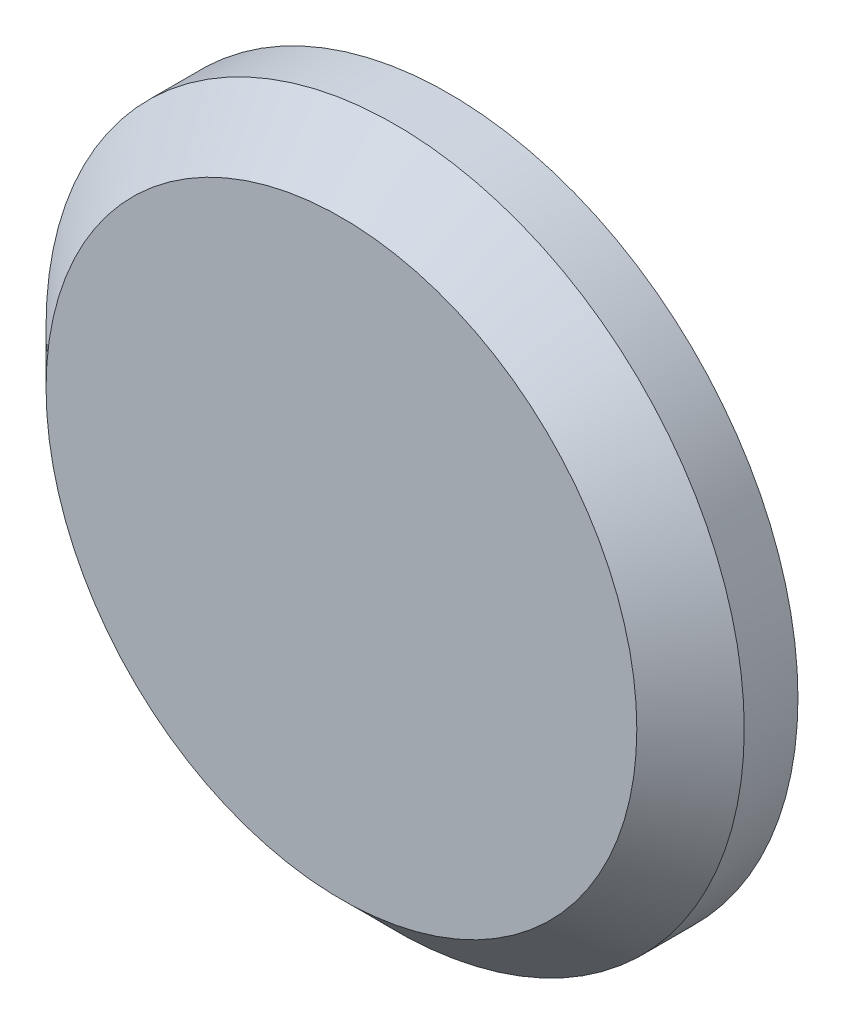
ISO-10303-21;
HEADER;
FILE_DESCRIPTION(('STEP AP214'),'2;1');
FILE_NAME('part.step','',(''),(''),'','','');
FILE_SCHEMA(('AUTOMOTIVE_DESIGN { 1 0 10303 214 1 1 1 1 }'));
ENDSEC;
DATA;
#1=APPLICATION_CONTEXT('core data for automotive mechanical design processes');
#2=APPLICATION_PROTOCOL_DEFINITION('international standard','automotive_design',2000,#1);
#3=PRODUCT_CONTEXT('',#1,'mechanical');
#4=PRODUCT('Part','Part','',(#3));
#5=PRODUCT_RELATED_PRODUCT_CATEGORY('part','',(#4));
#6=PRODUCT_DEFINITION_FORMATION('','',#4);
#7=PRODUCT_DEFINITION_CONTEXT('part definition',#1,'design');
#8=PRODUCT_DEFINITION('design','',#6,#7);
#9=PRODUCT_DEFINITION_SHAPE('','',#8);
#10=(LENGTH_UNIT() NAMED_UNIT(*) SI_UNIT(.MILLI.,.METRE.));
#11=(NAMED_UNIT(*) PLANE_ANGLE_UNIT() SI_UNIT($,.RADIAN.));
#12=(NAMED_UNIT(*) SI_UNIT($,.STERADIAN.) SOLID_ANGLE_UNIT());
#13=UNCERTAINTY_MEASURE_WITH_UNIT(LENGTH_MEASURE(1.E-05),#10,'distance_accuracy_value','');
#14=(GEOMETRIC_REPRESENTATION_CONTEXT(3) GLOBAL_UNCERTAINTY_ASSIGNED_CONTEXT((#13)) GLOBAL_UNIT_ASSIGNED_CONTEXT((#10,
#11,#12)) REPRESENTATION_CONTEXT('',''));
#15=CARTESIAN_POINT('',(0.,0.,0.));
#16=DIRECTION('',(0.,0.,1.));
#17=DIRECTION('',(1.,0.,0.));
#18=AXIS2_PLACEMENT_3D('',#15,#16,#17);
#19=CARTESIAN_POINT('',(0.,0.,14.));
#20=DIRECTION('',(0.,0.,-1.));
#21=DIRECTION('',(-1.,0.,0.));
#22=AXIS2_PLACEMENT_3D('',#19,#20,#21);
#23=CYLINDRICAL_SURFACE('',#22,4.1);
#24=CARTESIAN_POINT('',(0.,0.,10.));
#25=DIRECTION('',(0.,0.,1.));
#26=DIRECTION('',(1.,0.,0.));
#27=AXIS2_PLACEMENT_3D('',#24,#25,#26);
#28=CIRCLE('',#27,4.1);
#29=CARTESIAN_POINT('',(4.1,0.,10.));
#30=VERTEX_POINT('',#29);
#31=EDGE_CURVE('E52',#30,#30,#28,.T.);
#32=ORIENTED_EDGE('',*,*,#31,.F.);
#33=EDGE_LOOP('',(#32));
#34=FACE_BOUND('',#33,.T.);
#35=CARTESIAN_POINT('',(0.,0.,13.));
#36=DIRECTION('',(0.,0.,1.));
#37=DIRECTION('',(1.,0.,0.));
#38=AXIS2_PLACEMENT_3D('',#35,#36,#37);
#39=CIRCLE('',#38,4.1);
#40=CARTESIAN_POINT('',(4.1,0.,13.));
#41=VERTEX_POINT('',#40);
#42=EDGE_CURVE('E39',#41,#41,#39,.T.);
#43=ORIENTED_EDGE('',*,*,#42,.T.);
#44=EDGE_LOOP('',(#43));
#45=FACE_BOUND('',#44,.T.);
#46=ADVANCED_FACE('F35',(#34,#45),#23,.F.);
#47=CARTESIAN_POINT('',(0.,0.,14.));
#48=DIRECTION('',(0.,0.,1.));
#49=DIRECTION('',(1.,0.,0.));
#50=AXIS2_PLACEMENT_3D('',#47,#48,#49);
#51=PLANE('',#50);
#52=CARTESIAN_POINT('',(0.,0.,14.));
#53=DIRECTION('',(0.,0.,1.));
#54=DIRECTION('',(1.,0.,0.));
#55=AXIS2_PLACEMENT_3D('',#52,#53,#54);
#56=CIRCLE('',#55,11.);
#57=CARTESIAN_POINT('',(11.,0.,14.));
#58=VERTEX_POINT('',#57);
#59=EDGE_CURVE('E43',#58,#58,#56,.T.);
#60=ORIENTED_EDGE('',*,*,#59,.T.);
#61=EDGE_LOOP('',(#60));
#62=FACE_BOUND('',#61,.T.);
#63=ADVANCED_FACE('F70',(#62),#51,.T.);
#64=CARTESIAN_POINT('',(0.,0.,10.));
#65=DIRECTION('',(0.,0.,1.));
#66=DIRECTION('',(1.,0.,0.));
#67=AXIS2_PLACEMENT_3D('',#64,#65,#66);
#68=PLANE('',#67);
#69=CARTESIAN_POINT('',(0.,0.,10.));
#70=DIRECTION('',(0.,0.,1.));
#71=DIRECTION('',(1.,0.,0.));
#72=AXIS2_PLACEMENT_3D('',#69,#70,#71);
#73=CIRCLE('',#72,13.);
#74=CARTESIAN_POINT('',(13.,0.,10.));
#75=VERTEX_POINT('',#74);
#76=EDGE_CURVE('E47',#75,#75,#73,.T.);
#77=ORIENTED_EDGE('',*,*,#76,.F.);
#78=EDGE_LOOP('',(#77));
#79=FACE_BOUND('',#78,.T.);
#80=ORIENTED_EDGE('',*,*,#31,.T.);
#81=EDGE_LOOP('',(#80));
#82=FACE_BOUND('',#81,.T.);
#83=ADVANCED_FACE('F75',(#79,#82),#68,.F.);
#84=CARTESIAN_POINT('',(0.,0.,14.));
#85=DIRECTION('',(0.,0.,-1.));
#86=DIRECTION('',(-1.,0.,0.));
#87=AXIS2_PLACEMENT_3D('',#84,#85,#86);
#88=CYLINDRICAL_SURFACE('',#87,13.);
#89=CARTESIAN_POINT('',(0.,0.,12.));
#90=DIRECTION('',(0.,0.,1.));
#91=DIRECTION('',(1.,0.,0.));
#92=AXIS2_PLACEMENT_3D('',#89,#90,#91);
#93=CIRCLE('',#92,13.);
#94=CARTESIAN_POINT('',(13.,0.,12.));
#95=VERTEX_POINT('',#94);
#96=EDGE_CURVE('E10',#95,#95,#93,.F.);
#97=ORIENTED_EDGE('',*,*,#96,.T.);
#98=EDGE_LOOP('',(#97));
#99=FACE_BOUND('',#98,.T.);
#100=ORIENTED_EDGE('',*,*,#76,.T.);
#101=EDGE_LOOP('',(#100));
#102=FACE_BOUND('',#101,.T.);
#103=ADVANCED_FACE('F66',(#99,#102),#88,.T.);
#104=CARTESIAN_POINT('',(0.,0.,14.));
#105=DIRECTION('',(0.,0.,-1.));
#106=DIRECTION('',(-1.,0.,0.));
#107=AXIS2_PLACEMENT_3D('',#104,#105,#106);
#108=CONICAL_SURFACE('',#107,11.,0.785398163397446);
#109=ORIENTED_EDGE('',*,*,#96,.F.);
#110=EDGE_LOOP('',(#109));
#111=FACE_BOUND('',#110,.T.);
#112=ORIENTED_EDGE('',*,*,#59,.F.);
#113=EDGE_LOOP('',(#112));
#114=FACE_BOUND('',#113,.T.);
#115=ADVANCED_FACE('F37',(#111,#114),#108,.T.);
#116=CARTESIAN_POINT('',(0.,0.,13.));
#117=DIRECTION('',(0.,0.,1.));
#118=DIRECTION('',(1.,0.,0.));
#119=AXIS2_PLACEMENT_3D('',#116,#117,#118);
#120=PLANE('',#119);
#121=ORIENTED_EDGE('',*,*,#42,.F.);
#122=EDGE_LOOP('',(#121));
#123=FACE_BOUND('',#122,.T.);
#124=ADVANCED_FACE('F60',(#123),#120,.F.);
#125=CLOSED_SHELL('',(#46,#63,#83,#103,#115,#124));
#126=MANIFOLD_SOLID_BREP('B2',#125);
#127=ADVANCED_BREP_SHAPE_REPRESENTATION('',(#18,#126),#14);
#128=SHAPE_DEFINITION_REPRESENTATION(#9,#127);
ENDSEC;
END-ISO-10303-21;
